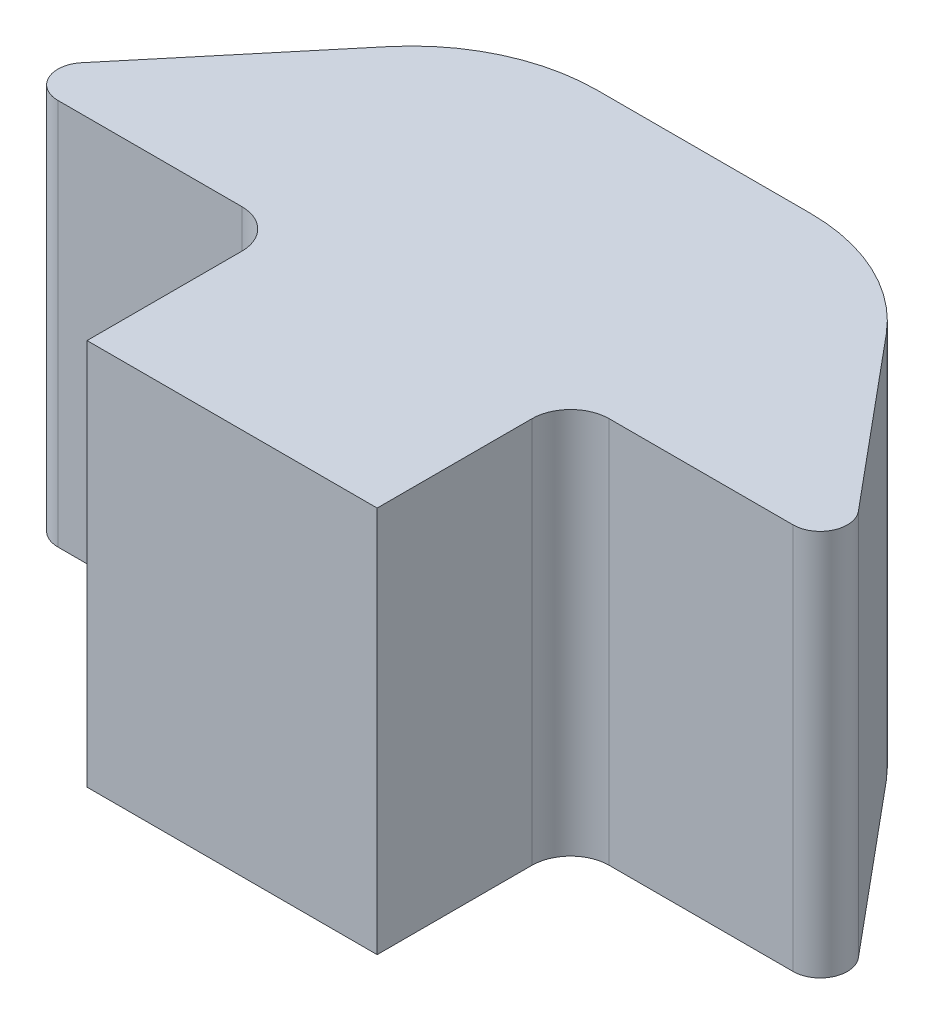
ISO-10303-21;
HEADER;
FILE_DESCRIPTION(('STEP AP214'),'2;1');
FILE_NAME('part.step','',(''),(''),'','','');
FILE_SCHEMA(('AUTOMOTIVE_DESIGN { 1 0 10303 214 1 1 1 1 }'));
ENDSEC;
DATA;
#1=APPLICATION_CONTEXT('core data for automotive mechanical design processes');
#2=APPLICATION_PROTOCOL_DEFINITION('international standard','automotive_design',2000,#1);
#3=PRODUCT_CONTEXT('',#1,'mechanical');
#4=PRODUCT('Part','Part','',(#3));
#5=PRODUCT_RELATED_PRODUCT_CATEGORY('part','',(#4));
#6=PRODUCT_DEFINITION_FORMATION('','',#4);
#7=PRODUCT_DEFINITION_CONTEXT('part definition',#1,'design');
#8=PRODUCT_DEFINITION('design','',#6,#7);
#9=PRODUCT_DEFINITION_SHAPE('','',#8);
#10=(LENGTH_UNIT() NAMED_UNIT(*) SI_UNIT(.MILLI.,.METRE.));
#11=(NAMED_UNIT(*) PLANE_ANGLE_UNIT() SI_UNIT($,.RADIAN.));
#12=(NAMED_UNIT(*) SI_UNIT($,.STERADIAN.) SOLID_ANGLE_UNIT());
#13=UNCERTAINTY_MEASURE_WITH_UNIT(LENGTH_MEASURE(1.E-05),#10,'distance_accuracy_value','');
#14=(GEOMETRIC_REPRESENTATION_CONTEXT(3) GLOBAL_UNCERTAINTY_ASSIGNED_CONTEXT((#13)) GLOBAL_UNIT_ASSIGNED_CONTEXT((#10,
#11,#12)) REPRESENTATION_CONTEXT('',''));
#15=CARTESIAN_POINT('',(0.,0.,0.));
#16=DIRECTION('',(0.,0.,1.));
#17=DIRECTION('',(1.,0.,0.));
#18=AXIS2_PLACEMENT_3D('',#15,#16,#17);
#19=CARTESIAN_POINT('',(0.,10.,0.));
#20=DIRECTION('',(0.,0.,1.));
#21=DIRECTION('',(1.,0.,0.));
#22=AXIS2_PLACEMENT_3D('',#19,#20,#21);
#23=PLANE('',#22);
#24=DIRECTION('',(-1.,0.,0.));
#25=VECTOR('',#24,1.);
#26=CARTESIAN_POINT('',(0.,10.,0.));
#27=LINE('',#26,#25);
#28=CARTESIAN_POINT('',(2.75180025927468,10.,0.));
#29=VERTEX_POINT('',#28);
#30=CARTESIAN_POINT('',(-2.75180025927468,10.,0.));
#31=VERTEX_POINT('',#30);
#32=EDGE_CURVE('E189',#29,#31,#27,.T.);
#33=ORIENTED_EDGE('',*,*,#32,.F.);
#34=DIRECTION('',(0.,-1.,0.));
#35=VECTOR('',#34,1.);
#36=CARTESIAN_POINT('',(2.75180025927468,0.,0.));
#37=LINE('',#36,#35);
#38=CARTESIAN_POINT('',(2.75180025927468,0.,0.));
#39=VERTEX_POINT('',#38);
#40=EDGE_CURVE('E271',#29,#39,#37,.T.);
#41=ORIENTED_EDGE('',*,*,#40,.T.);
#42=DIRECTION('',(-1.,0.,0.));
#43=VECTOR('',#42,1.);
#44=CARTESIAN_POINT('',(0.,0.,0.));
#45=LINE('',#44,#43);
#46=CARTESIAN_POINT('',(-2.75180025927468,0.,0.));
#47=VERTEX_POINT('',#46);
#48=EDGE_CURVE('E177',#39,#47,#45,.T.);
#49=ORIENTED_EDGE('',*,*,#48,.T.);
#50=DIRECTION('',(0.,-1.,0.));
#51=VECTOR('',#50,1.);
#52=CARTESIAN_POINT('',(-2.75180025927468,10.,0.));
#53=LINE('',#52,#51);
#54=EDGE_CURVE('E268',#47,#31,#53,.F.);
#55=ORIENTED_EDGE('',*,*,#54,.T.);
#56=EDGE_LOOP('',(#33,#41,#49,#55));
#57=FACE_BOUND('',#56,.T.);
#58=ADVANCED_FACE('F44',(#57),#23,.F.);
#59=CARTESIAN_POINT('',(-5.,10.,0.));
#60=DIRECTION('',(0.768221279597376,0.,0.64018439966448));
#61=DIRECTION('',(0.64018439966448,0.,-0.768221279597376));
#62=AXIS2_PLACEMENT_3D('',#59,#60,#61);
#63=PLANE('',#62);
#64=DIRECTION('',(-0.64018439966448,0.,0.768221279597376));
#65=VECTOR('',#64,1.);
#66=CARTESIAN_POINT('',(-5.,10.,0.));
#67=LINE('',#66,#65);
#68=CARTESIAN_POINT('',(-6.43926240134208,10.,1.7271148816105));
#69=VERTEX_POINT('',#68);
#70=CARTESIAN_POINT('',(-10.0432257668624,10.,6.05187092023486));
#71=VERTEX_POINT('',#70);
#72=EDGE_CURVE('E192',#69,#71,#67,.T.);
#73=ORIENTED_EDGE('',*,*,#72,.F.);
#74=DIRECTION('',(0.,-1.,0.));
#75=VECTOR('',#74,1.);
#76=CARTESIAN_POINT('',(-6.43926240134208,10.,1.7271148816105));
#77=LINE('',#76,#75);
#78=CARTESIAN_POINT('',(-6.43926240134208,0.,1.7271148816105));
#79=VERTEX_POINT('',#78);
#80=EDGE_CURVE('E11',#69,#79,#77,.T.);
#81=ORIENTED_EDGE('',*,*,#80,.T.);
#82=DIRECTION('',(-0.64018439966448,0.,0.768221279597376));
#83=VECTOR('',#82,1.);
#84=CARTESIAN_POINT('',(-5.,0.,0.));
#85=LINE('',#84,#83);
#86=CARTESIAN_POINT('',(-10.0432257668624,0.,6.05187092023486));
#87=VERTEX_POINT('',#86);
#88=EDGE_CURVE('E183',#79,#87,#85,.T.);
#89=ORIENTED_EDGE('',*,*,#88,.T.);
#90=DIRECTION('',(0.,-1.,0.));
#91=VECTOR('',#90,1.);
#92=CARTESIAN_POINT('',(-10.0432257668624,10.,6.05187092023486));
#93=LINE('',#92,#91);
#94=EDGE_CURVE('E222',#87,#71,#93,.F.);
#95=ORIENTED_EDGE('',*,*,#94,.T.);
#96=EDGE_LOOP('',(#73,#81,#89,#95));
#97=FACE_BOUND('',#96,.T.);
#98=ADVANCED_FACE('F336',(#97),#63,.F.);
#99=CARTESIAN_POINT('',(-11.,10.,7.2));
#100=DIRECTION('',(0.,0.,-1.));
#101=DIRECTION('',(-1.,0.,0.));
#102=AXIS2_PLACEMENT_3D('',#99,#100,#101);
#103=PLANE('',#102);
#104=DIRECTION('',(1.,0.,0.));
#105=VECTOR('',#104,1.);
#106=CARTESIAN_POINT('',(-11.,0.,7.2));
#107=LINE('',#106,#105);
#108=CARTESIAN_POINT('',(-9.50547087114422,0.,7.2));
#109=VERTEX_POINT('',#108);
#110=CARTESIAN_POINT('',(-4.75,0.,7.2));
#111=VERTEX_POINT('',#110);
#112=EDGE_CURVE('E203',#109,#111,#107,.T.);
#113=ORIENTED_EDGE('',*,*,#112,.T.);
#114=DIRECTION('',(0.,-1.,0.));
#115=VECTOR('',#114,1.);
#116=CARTESIAN_POINT('',(-4.75,10.,7.2));
#117=LINE('',#116,#115);
#118=CARTESIAN_POINT('',(-4.75,10.,7.2));
#119=VERTEX_POINT('',#118);
#120=EDGE_CURVE('E233',#111,#119,#117,.F.);
#121=ORIENTED_EDGE('',*,*,#120,.T.);
#122=DIRECTION('',(1.,0.,0.));
#123=VECTOR('',#122,1.);
#124=CARTESIAN_POINT('',(-11.,10.,7.2));
#125=LINE('',#124,#123);
#126=CARTESIAN_POINT('',(-9.50547087114422,10.,7.2));
#127=VERTEX_POINT('',#126);
#128=EDGE_CURVE('E195',#127,#119,#125,.T.);
#129=ORIENTED_EDGE('',*,*,#128,.F.);
#130=DIRECTION('',(0.,-1.,0.));
#131=VECTOR('',#130,1.);
#132=CARTESIAN_POINT('',(-9.50547087114422,10.,7.2));
#133=LINE('',#132,#131);
#134=EDGE_CURVE('E214',#127,#109,#133,.T.);
#135=ORIENTED_EDGE('',*,*,#134,.T.);
#136=EDGE_LOOP('',(#113,#121,#129,#135));
#137=FACE_BOUND('',#136,.T.);
#138=ADVANCED_FACE('F328',(#137),#103,.F.);
#139=CARTESIAN_POINT('',(-3.75,10.,7.2));
#140=DIRECTION('',(1.,0.,0.));
#141=DIRECTION('',(0.,0.,-1.));
#142=AXIS2_PLACEMENT_3D('',#139,#140,#141);
#143=PLANE('',#142);
#144=DIRECTION('',(0.,0.,1.));
#145=VECTOR('',#144,1.);
#146=CARTESIAN_POINT('',(-3.75,10.,7.2));
#147=LINE('',#146,#145);
#148=CARTESIAN_POINT('',(-3.75,10.,8.2));
#149=VERTEX_POINT('',#148);
#150=CARTESIAN_POINT('',(-3.75,10.,12.2));
#151=VERTEX_POINT('',#150);
#152=EDGE_CURVE('E165',#149,#151,#147,.T.);
#153=ORIENTED_EDGE('',*,*,#152,.F.);
#154=DIRECTION('',(0.,-1.,0.));
#155=VECTOR('',#154,1.);
#156=CARTESIAN_POINT('',(-3.75,0.,8.2));
#157=LINE('',#156,#155);
#158=CARTESIAN_POINT('',(-3.75,0.,8.2));
#159=VERTEX_POINT('',#158);
#160=EDGE_CURVE('E229',#149,#159,#157,.T.);
#161=ORIENTED_EDGE('',*,*,#160,.T.);
#162=DIRECTION('',(0.,0.,1.));
#163=VECTOR('',#162,1.);
#164=CARTESIAN_POINT('',(-3.75,0.,7.2));
#165=LINE('',#164,#163);
#166=CARTESIAN_POINT('',(-3.75,0.,12.2));
#167=VERTEX_POINT('',#166);
#168=EDGE_CURVE('E207',#159,#167,#165,.T.);
#169=ORIENTED_EDGE('',*,*,#168,.T.);
#170=DIRECTION('',(0.,-1.,0.));
#171=VECTOR('',#170,1.);
#172=CARTESIAN_POINT('',(-3.75,10.,12.2));
#173=LINE('',#172,#171);
#174=EDGE_CURVE('E170',#151,#167,#173,.T.);
#175=ORIENTED_EDGE('',*,*,#174,.F.);
#176=EDGE_LOOP('',(#153,#161,#169,#175));
#177=FACE_BOUND('',#176,.T.);
#178=ADVANCED_FACE('F320',(#177),#143,.F.);
#179=CARTESIAN_POINT('',(-3.75,10.,12.2));
#180=DIRECTION('',(0.,0.,-1.));
#181=DIRECTION('',(-1.,0.,0.));
#182=AXIS2_PLACEMENT_3D('',#179,#180,#181);
#183=PLANE('',#182);
#184=DIRECTION('',(1.,0.,0.));
#185=VECTOR('',#184,1.);
#186=CARTESIAN_POINT('',(-3.75,0.,12.2));
#187=LINE('',#186,#185);
#188=CARTESIAN_POINT('',(3.75,0.,12.2));
#189=VERTEX_POINT('',#188);
#190=EDGE_CURVE('E175',#167,#189,#187,.T.);
#191=ORIENTED_EDGE('',*,*,#190,.T.);
#192=DIRECTION('',(0.,-1.,0.));
#193=VECTOR('',#192,1.);
#194=CARTESIAN_POINT('',(3.75,10.,12.2));
#195=LINE('',#194,#193);
#196=CARTESIAN_POINT('',(3.75,10.,12.2));
#197=VERTEX_POINT('',#196);
#198=EDGE_CURVE('E153',#197,#189,#195,.T.);
#199=ORIENTED_EDGE('',*,*,#198,.F.);
#200=DIRECTION('',(1.,0.,0.));
#201=VECTOR('',#200,1.);
#202=CARTESIAN_POINT('',(-3.75,10.,12.2));
#203=LINE('',#202,#201);
#204=EDGE_CURVE('E162',#151,#197,#203,.T.);
#205=ORIENTED_EDGE('',*,*,#204,.F.);
#206=ORIENTED_EDGE('',*,*,#174,.T.);
#207=EDGE_LOOP('',(#191,#199,#205,#206));
#208=FACE_BOUND('',#207,.T.);
#209=ADVANCED_FACE('F173',(#208),#183,.F.);
#210=CARTESIAN_POINT('',(0.,10.,0.));
#211=DIRECTION('',(0.,1.,0.));
#212=DIRECTION('',(0.,0.,1.));
#213=AXIS2_PLACEMENT_3D('',#210,#211,#212);
#214=PLANE('',#213);
#215=DIRECTION('',(0.64018439966448,0.,0.768221279597376));
#216=VECTOR('',#215,1.);
#217=CARTESIAN_POINT('',(5.,10.,0.));
#218=LINE('',#217,#216);
#219=CARTESIAN_POINT('',(6.43926240134208,10.,1.7271148816105));
#220=VERTEX_POINT('',#219);
#221=CARTESIAN_POINT('',(10.0432257668624,10.,6.05187092023487));
#222=VERTEX_POINT('',#221);
#223=EDGE_CURVE('E178',#220,#222,#218,.T.);
#224=ORIENTED_EDGE('',*,*,#223,.F.);
#225=CARTESIAN_POINT('',(2.75180025927468,10.,4.8));
#226=DIRECTION('',(0.,1.,0.));
#227=DIRECTION('',(0.,0.,1.));
#228=AXIS2_PLACEMENT_3D('',#225,#226,#227);
#229=CIRCLE('',#228,4.8);
#230=EDGE_CURVE('E53',#220,#29,#229,.T.);
#231=ORIENTED_EDGE('',*,*,#230,.T.);
#232=ORIENTED_EDGE('',*,*,#32,.T.);
#233=CARTESIAN_POINT('',(-2.75180025927468,10.,4.8));
#234=DIRECTION('',(0.,1.,0.));
#235=DIRECTION('',(0.,0.,1.));
#236=AXIS2_PLACEMENT_3D('',#233,#234,#235);
#237=CIRCLE('',#236,4.8);
#238=EDGE_CURVE('E60',#31,#69,#237,.T.);
#239=ORIENTED_EDGE('',*,*,#238,.T.);
#240=ORIENTED_EDGE('',*,*,#72,.T.);
#241=CARTESIAN_POINT('',(-9.50547087114422,10.,6.5));
#242=DIRECTION('',(0.,1.,0.));
#243=DIRECTION('',(0.,0.,1.));
#244=AXIS2_PLACEMENT_3D('',#241,#242,#243);
#245=CIRCLE('',#244,0.7);
#246=EDGE_CURVE('E226',#71,#127,#245,.T.);
#247=ORIENTED_EDGE('',*,*,#246,.T.);
#248=ORIENTED_EDGE('',*,*,#128,.T.);
#249=CARTESIAN_POINT('',(-4.75,10.,8.2));
#250=DIRECTION('',(0.,1.,0.));
#251=DIRECTION('',(0.,0.,1.));
#252=AXIS2_PLACEMENT_3D('',#249,#250,#251);
#253=CIRCLE('',#252,1.);
#254=EDGE_CURVE('E239',#119,#149,#253,.F.);
#255=ORIENTED_EDGE('',*,*,#254,.T.);
#256=ORIENTED_EDGE('',*,*,#152,.T.);
#257=ORIENTED_EDGE('',*,*,#204,.T.);
#258=DIRECTION('',(0.,0.,1.));
#259=VECTOR('',#258,1.);
#260=CARTESIAN_POINT('',(3.75,10.,7.2));
#261=LINE('',#260,#259);
#262=CARTESIAN_POINT('',(3.75,10.,8.2));
#263=VERTEX_POINT('',#262);
#264=EDGE_CURVE('E148',#263,#197,#261,.T.);
#265=ORIENTED_EDGE('',*,*,#264,.F.);
#266=CARTESIAN_POINT('',(4.75,10.,8.2));
#267=DIRECTION('',(0.,1.,0.));
#268=DIRECTION('',(0.,0.,1.));
#269=AXIS2_PLACEMENT_3D('',#266,#267,#268);
#270=CIRCLE('',#269,1.);
#271=CARTESIAN_POINT('',(4.75,10.,7.2));
#272=VERTEX_POINT('',#271);
#273=EDGE_CURVE('E265',#263,#272,#270,.F.);
#274=ORIENTED_EDGE('',*,*,#273,.T.);
#275=DIRECTION('',(-1.,0.,0.));
#276=VECTOR('',#275,1.);
#277=CARTESIAN_POINT('',(11.,10.,7.2));
#278=LINE('',#277,#276);
#279=CARTESIAN_POINT('',(9.50547087114422,10.,7.2));
#280=VERTEX_POINT('',#279);
#281=EDGE_CURVE('E158',#280,#272,#278,.T.);
#282=ORIENTED_EDGE('',*,*,#281,.F.);
#283=CARTESIAN_POINT('',(9.50547087114422,10.,6.5));
#284=DIRECTION('',(0.,1.,0.));
#285=DIRECTION('',(0.,0.,1.));
#286=AXIS2_PLACEMENT_3D('',#283,#284,#285);
#287=CIRCLE('',#286,0.7);
#288=EDGE_CURVE('E252',#280,#222,#287,.T.);
#289=ORIENTED_EDGE('',*,*,#288,.T.);
#290=EDGE_LOOP('',(#224,#231,#232,#239,#240,#247,#248,#255,#256,#257,#265,#274,#282,#289));
#291=FACE_BOUND('',#290,.T.);
#292=ADVANCED_FACE('F163',(#291),#214,.T.);
#293=CARTESIAN_POINT('',(0.,0.,0.));
#294=DIRECTION('',(0.,1.,0.));
#295=DIRECTION('',(0.,0.,1.));
#296=AXIS2_PLACEMENT_3D('',#293,#294,#295);
#297=PLANE('',#296);
#298=ORIENTED_EDGE('',*,*,#48,.F.);
#299=CARTESIAN_POINT('',(2.75180025927468,0.,4.8));
#300=DIRECTION('',(0.,1.,0.));
#301=DIRECTION('',(0.,0.,1.));
#302=AXIS2_PLACEMENT_3D('',#299,#300,#301);
#303=CIRCLE('',#302,4.8);
#304=CARTESIAN_POINT('',(6.43926240134208,0.,1.7271148816105));
#305=VERTEX_POINT('',#304);
#306=EDGE_CURVE('E278',#39,#305,#303,.F.);
#307=ORIENTED_EDGE('',*,*,#306,.T.);
#308=DIRECTION('',(0.64018439966448,0.,0.768221279597376));
#309=VECTOR('',#308,1.);
#310=CARTESIAN_POINT('',(5.,0.,0.));
#311=LINE('',#310,#309);
#312=CARTESIAN_POINT('',(10.0432257668624,0.,6.05187092023487));
#313=VERTEX_POINT('',#312);
#314=EDGE_CURVE('E159',#305,#313,#311,.T.);
#315=ORIENTED_EDGE('',*,*,#314,.T.);
#316=CARTESIAN_POINT('',(9.50547087114422,0.,6.5));
#317=DIRECTION('',(0.,1.,0.));
#318=DIRECTION('',(0.,0.,1.));
#319=AXIS2_PLACEMENT_3D('',#316,#317,#318);
#320=CIRCLE('',#319,0.7);
#321=CARTESIAN_POINT('',(9.50547087114422,0.,7.2));
#322=VERTEX_POINT('',#321);
#323=EDGE_CURVE('E246',#313,#322,#320,.F.);
#324=ORIENTED_EDGE('',*,*,#323,.T.);
#325=DIRECTION('',(-1.,0.,0.));
#326=VECTOR('',#325,1.);
#327=CARTESIAN_POINT('',(11.,0.,7.2));
#328=LINE('',#327,#326);
#329=CARTESIAN_POINT('',(4.75,0.,7.2));
#330=VERTEX_POINT('',#329);
#331=EDGE_CURVE('E299',#322,#330,#328,.T.);
#332=ORIENTED_EDGE('',*,*,#331,.T.);
#333=CARTESIAN_POINT('',(4.75,0.,8.2));
#334=DIRECTION('',(0.,1.,0.));
#335=DIRECTION('',(0.,0.,1.));
#336=AXIS2_PLACEMENT_3D('',#333,#334,#335);
#337=CIRCLE('',#336,1.);
#338=CARTESIAN_POINT('',(3.75,0.,8.2));
#339=VERTEX_POINT('',#338);
#340=EDGE_CURVE('E262',#330,#339,#337,.T.);
#341=ORIENTED_EDGE('',*,*,#340,.T.);
#342=DIRECTION('',(0.,0.,1.));
#343=VECTOR('',#342,1.);
#344=CARTESIAN_POINT('',(3.75,0.,7.2));
#345=LINE('',#344,#343);
#346=EDGE_CURVE('E302',#339,#189,#345,.T.);
#347=ORIENTED_EDGE('',*,*,#346,.T.);
#348=ORIENTED_EDGE('',*,*,#190,.F.);
#349=ORIENTED_EDGE('',*,*,#168,.F.);
#350=CARTESIAN_POINT('',(-4.75,0.,8.2));
#351=DIRECTION('',(0.,1.,0.));
#352=DIRECTION('',(0.,0.,1.));
#353=AXIS2_PLACEMENT_3D('',#350,#351,#352);
#354=CIRCLE('',#353,1.);
#355=EDGE_CURVE('E236',#159,#111,#354,.T.);
#356=ORIENTED_EDGE('',*,*,#355,.T.);
#357=ORIENTED_EDGE('',*,*,#112,.F.);
#358=CARTESIAN_POINT('',(-9.50547087114422,0.,6.5));
#359=DIRECTION('',(0.,1.,0.));
#360=DIRECTION('',(0.,0.,1.));
#361=AXIS2_PLACEMENT_3D('',#358,#359,#360);
#362=CIRCLE('',#361,0.7);
#363=EDGE_CURVE('E218',#109,#87,#362,.F.);
#364=ORIENTED_EDGE('',*,*,#363,.T.);
#365=ORIENTED_EDGE('',*,*,#88,.F.);
#366=CARTESIAN_POINT('',(-2.75180025927468,0.,4.8));
#367=DIRECTION('',(0.,1.,0.));
#368=DIRECTION('',(0.,0.,1.));
#369=AXIS2_PLACEMENT_3D('',#366,#367,#368);
#370=CIRCLE('',#369,4.8);
#371=EDGE_CURVE('E275',#79,#47,#370,.F.);
#372=ORIENTED_EDGE('',*,*,#371,.T.);
#373=EDGE_LOOP('',(#298,#307,#315,#324,#332,#341,#347,#348,#349,#356,#357,#364,#365,#372));
#374=FACE_BOUND('',#373,.T.);
#375=ADVANCED_FACE('F294',(#374),#297,.F.);
#376=CARTESIAN_POINT('',(-9.50547087114422,10.,6.5));
#377=DIRECTION('',(0.,-1.,0.));
#378=DIRECTION('',(0.,0.,-1.));
#379=AXIS2_PLACEMENT_3D('',#376,#377,#378);
#380=CYLINDRICAL_SURFACE('',#379,0.7);
#381=ORIENTED_EDGE('',*,*,#246,.F.);
#382=ORIENTED_EDGE('',*,*,#94,.F.);
#383=ORIENTED_EDGE('',*,*,#363,.F.);
#384=ORIENTED_EDGE('',*,*,#134,.F.);
#385=EDGE_LOOP('',(#381,#382,#383,#384));
#386=FACE_BOUND('',#385,.T.);
#387=ADVANCED_FACE('F333',(#386),#380,.T.);
#388=CARTESIAN_POINT('',(-4.75,10.,8.2));
#389=DIRECTION('',(0.,1.,0.));
#390=DIRECTION('',(0.,0.,1.));
#391=AXIS2_PLACEMENT_3D('',#388,#389,#390);
#392=CYLINDRICAL_SURFACE('',#391,1.);
#393=ORIENTED_EDGE('',*,*,#254,.F.);
#394=ORIENTED_EDGE('',*,*,#120,.F.);
#395=ORIENTED_EDGE('',*,*,#355,.F.);
#396=ORIENTED_EDGE('',*,*,#160,.F.);
#397=EDGE_LOOP('',(#393,#394,#395,#396));
#398=FACE_BOUND('',#397,.T.);
#399=ADVANCED_FACE('F324',(#398),#392,.F.);
#400=CARTESIAN_POINT('',(3.75,10.,7.2));
#401=DIRECTION('',(1.,0.,0.));
#402=DIRECTION('',(0.,0.,-1.));
#403=AXIS2_PLACEMENT_3D('',#400,#401,#402);
#404=PLANE('',#403);
#405=ORIENTED_EDGE('',*,*,#346,.F.);
#406=DIRECTION('',(0.,-1.,0.));
#407=VECTOR('',#406,1.);
#408=CARTESIAN_POINT('',(3.75,10.,8.2));
#409=LINE('',#408,#407);
#410=EDGE_CURVE('E155',#339,#263,#409,.F.);
#411=ORIENTED_EDGE('',*,*,#410,.T.);
#412=ORIENTED_EDGE('',*,*,#264,.T.);
#413=ORIENTED_EDGE('',*,*,#198,.T.);
#414=EDGE_LOOP('',(#405,#411,#412,#413));
#415=FACE_BOUND('',#414,.T.);
#416=ADVANCED_FACE('F151',(#415),#404,.T.);
#417=CARTESIAN_POINT('',(11.,10.,7.2));
#418=DIRECTION('',(0.,0.,1.));
#419=DIRECTION('',(1.,0.,0.));
#420=AXIS2_PLACEMENT_3D('',#417,#418,#419);
#421=PLANE('',#420);
#422=ORIENTED_EDGE('',*,*,#281,.T.);
#423=DIRECTION('',(0.,-1.,0.));
#424=VECTOR('',#423,1.);
#425=CARTESIAN_POINT('',(4.75,0.,7.2));
#426=LINE('',#425,#424);
#427=EDGE_CURVE('E256',#272,#330,#426,.T.);
#428=ORIENTED_EDGE('',*,*,#427,.T.);
#429=ORIENTED_EDGE('',*,*,#331,.F.);
#430=DIRECTION('',(0.,-1.,0.));
#431=VECTOR('',#430,1.);
#432=CARTESIAN_POINT('',(9.50547087114422,10.,7.2));
#433=LINE('',#432,#431);
#434=EDGE_CURVE('E249',#322,#280,#433,.F.);
#435=ORIENTED_EDGE('',*,*,#434,.T.);
#436=EDGE_LOOP('',(#422,#428,#429,#435));
#437=FACE_BOUND('',#436,.T.);
#438=ADVANCED_FACE('F312',(#437),#421,.T.);
#439=CARTESIAN_POINT('',(5.,10.,0.));
#440=DIRECTION('',(0.768221279597376,0.,-0.64018439966448));
#441=DIRECTION('',(-0.64018439966448,0.,-0.768221279597376));
#442=AXIS2_PLACEMENT_3D('',#439,#440,#441);
#443=PLANE('',#442);
#444=ORIENTED_EDGE('',*,*,#314,.F.);
#445=DIRECTION('',(0.,-1.,0.));
#446=VECTOR('',#445,1.);
#447=CARTESIAN_POINT('',(6.43926240134208,10.,1.7271148816105));
#448=LINE('',#447,#446);
#449=EDGE_CURVE('E68',#305,#220,#448,.F.);
#450=ORIENTED_EDGE('',*,*,#449,.T.);
#451=ORIENTED_EDGE('',*,*,#223,.T.);
#452=DIRECTION('',(0.,-1.,0.));
#453=VECTOR('',#452,1.);
#454=CARTESIAN_POINT('',(10.0432257668624,10.,6.05187092023487));
#455=LINE('',#454,#453);
#456=EDGE_CURVE('E242',#222,#313,#455,.T.);
#457=ORIENTED_EDGE('',*,*,#456,.T.);
#458=EDGE_LOOP('',(#444,#450,#451,#457));
#459=FACE_BOUND('',#458,.T.);
#460=ADVANCED_FACE('F296',(#459),#443,.T.);
#461=CARTESIAN_POINT('',(9.50547087114422,10.,6.5));
#462=DIRECTION('',(0.,-1.,0.));
#463=DIRECTION('',(0.,0.,-1.));
#464=AXIS2_PLACEMENT_3D('',#461,#462,#463);
#465=CYLINDRICAL_SURFACE('',#464,0.7);
#466=ORIENTED_EDGE('',*,*,#288,.F.);
#467=ORIENTED_EDGE('',*,*,#434,.F.);
#468=ORIENTED_EDGE('',*,*,#323,.F.);
#469=ORIENTED_EDGE('',*,*,#456,.F.);
#470=EDGE_LOOP('',(#466,#467,#468,#469));
#471=FACE_BOUND('',#470,.T.);
#472=ADVANCED_FACE('F356',(#471),#465,.T.);
#473=CARTESIAN_POINT('',(4.75,10.,8.2));
#474=DIRECTION('',(0.,1.,0.));
#475=DIRECTION('',(0.,0.,1.));
#476=AXIS2_PLACEMENT_3D('',#473,#474,#475);
#477=CYLINDRICAL_SURFACE('',#476,1.);
#478=ORIENTED_EDGE('',*,*,#273,.F.);
#479=ORIENTED_EDGE('',*,*,#410,.F.);
#480=ORIENTED_EDGE('',*,*,#340,.F.);
#481=ORIENTED_EDGE('',*,*,#427,.F.);
#482=EDGE_LOOP('',(#478,#479,#480,#481));
#483=FACE_BOUND('',#482,.T.);
#484=ADVANCED_FACE('F316',(#483),#477,.F.);
#485=CARTESIAN_POINT('',(2.75180025927468,10.,4.8));
#486=DIRECTION('',(0.,1.,0.));
#487=DIRECTION('',(0.,0.,1.));
#488=AXIS2_PLACEMENT_3D('',#485,#486,#487);
#489=CYLINDRICAL_SURFACE('',#488,4.8);
#490=ORIENTED_EDGE('',*,*,#230,.F.);
#491=ORIENTED_EDGE('',*,*,#449,.F.);
#492=ORIENTED_EDGE('',*,*,#306,.F.);
#493=ORIENTED_EDGE('',*,*,#40,.F.);
#494=EDGE_LOOP('',(#490,#491,#492,#493));
#495=FACE_BOUND('',#494,.T.);
#496=ADVANCED_FACE('F292',(#495),#489,.T.);
#497=CARTESIAN_POINT('',(-2.75180025927468,10.,4.8));
#498=DIRECTION('',(0.,-1.,0.));
#499=DIRECTION('',(0.,0.,-1.));
#500=AXIS2_PLACEMENT_3D('',#497,#498,#499);
#501=CYLINDRICAL_SURFACE('',#500,4.8);
#502=ORIENTED_EDGE('',*,*,#238,.F.);
#503=ORIENTED_EDGE('',*,*,#54,.F.);
#504=ORIENTED_EDGE('',*,*,#371,.F.);
#505=ORIENTED_EDGE('',*,*,#80,.F.);
#506=EDGE_LOOP('',(#502,#503,#504,#505));
#507=FACE_BOUND('',#506,.T.);
#508=ADVANCED_FACE('F46',(#507),#501,.T.);
#509=CLOSED_SHELL('',(#58,#98,#138,#178,#209,#292,#375,#387,#399,#416,#438,#460,#472,#484,#496,#508));
#510=MANIFOLD_SOLID_BREP('B2',#509);
#511=ADVANCED_BREP_SHAPE_REPRESENTATION('',(#18,#510),#14);
#512=SHAPE_DEFINITION_REPRESENTATION(#9,#511);
ENDSEC;
END-ISO-10303-21;
